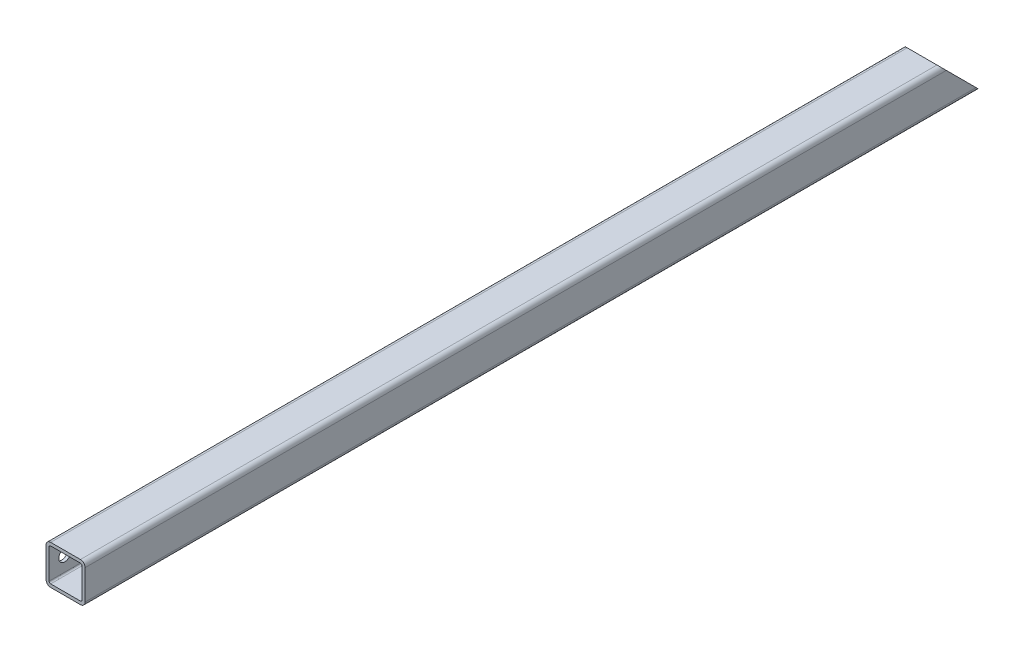
ISO-10303-21;
HEADER;
FILE_DESCRIPTION(('STEP AP214'),'2;1');
FILE_NAME('part.step','',(''),(''),'','','');
FILE_SCHEMA(('AUTOMOTIVE_DESIGN { 1 0 10303 214 1 1 1 1 }'));
ENDSEC;
DATA;
#1=APPLICATION_CONTEXT('core data for automotive mechanical design processes');
#2=APPLICATION_PROTOCOL_DEFINITION('international standard','automotive_design',2000,#1);
#3=PRODUCT_CONTEXT('',#1,'mechanical');
#4=PRODUCT('Part','Part','',(#3));
#5=PRODUCT_RELATED_PRODUCT_CATEGORY('part','',(#4));
#6=PRODUCT_DEFINITION_FORMATION('','',#4);
#7=PRODUCT_DEFINITION_CONTEXT('part definition',#1,'design');
#8=PRODUCT_DEFINITION('design','',#6,#7);
#9=PRODUCT_DEFINITION_SHAPE('','',#8);
#10=(LENGTH_UNIT() NAMED_UNIT(*) SI_UNIT(.MILLI.,.METRE.));
#11=(NAMED_UNIT(*) PLANE_ANGLE_UNIT() SI_UNIT($,.RADIAN.));
#12=(NAMED_UNIT(*) SI_UNIT($,.STERADIAN.) SOLID_ANGLE_UNIT());
#13=UNCERTAINTY_MEASURE_WITH_UNIT(LENGTH_MEASURE(1.E-05),#10,'distance_accuracy_value','');
#14=(GEOMETRIC_REPRESENTATION_CONTEXT(3) GLOBAL_UNCERTAINTY_ASSIGNED_CONTEXT((#13)) GLOBAL_UNIT_ASSIGNED_CONTEXT((#10,
#11,#12)) REPRESENTATION_CONTEXT('',''));
#15=CARTESIAN_POINT('',(0.,0.,0.));
#16=DIRECTION('',(0.,0.,1.));
#17=DIRECTION('',(1.,0.,0.));
#18=AXIS2_PLACEMENT_3D('',#15,#16,#17);
#19=CARTESIAN_POINT('',(-6.25277607468888E-12,1.69109171110904E-11,560.));
#20=DIRECTION('',(0.,0.,1.));
#21=DIRECTION('',(0.,-1.,0.));
#22=AXIS2_PLACEMENT_3D('',#19,#20,#21);
#23=PLANE('',#22);
#24=DIRECTION('',(0.,1.,0.));
#25=VECTOR('',#24,1.);
#26=CARTESIAN_POINT('',(-12.5000000000063,-4.7499999999831,560.));
#27=LINE('',#26,#25);
#28=CARTESIAN_POINT('',(-12.5000000000063,-9.49999999998312,560.));
#29=VERTEX_POINT('',#28);
#30=CARTESIAN_POINT('',(-12.5000000000063,9.50000000001687,560.));
#31=VERTEX_POINT('',#30);
#32=EDGE_CURVE('E241',#29,#31,#27,.T.);
#33=ORIENTED_EDGE('',*,*,#32,.F.);
#34=CARTESIAN_POINT('',(-9.50000000000625,-9.49999999998312,560.));
#35=DIRECTION('',(0.,0.,-1.));
#36=DIRECTION('',(1.,0.,0.));
#37=AXIS2_PLACEMENT_3D('',#34,#35,#36);
#38=CIRCLE('',#37,3.);
#39=CARTESIAN_POINT('',(-9.50000000000625,-12.4999999999831,560.));
#40=VERTEX_POINT('',#39);
#41=EDGE_CURVE('E313',#40,#29,#38,.T.);
#42=ORIENTED_EDGE('',*,*,#41,.F.);
#43=DIRECTION('',(-1.,0.,0.));
#44=VECTOR('',#43,1.);
#45=CARTESIAN_POINT('',(4.74999999999376,-12.4999999999831,560.));
#46=LINE('',#45,#44);
#47=CARTESIAN_POINT('',(9.49999999999374,-12.4999999999831,560.));
#48=VERTEX_POINT('',#47);
#49=EDGE_CURVE('E324',#48,#40,#46,.T.);
#50=ORIENTED_EDGE('',*,*,#49,.F.);
#51=CARTESIAN_POINT('',(9.49999999999374,-9.49999999998312,560.));
#52=DIRECTION('',(0.,0.,-1.));
#53=DIRECTION('',(0.,1.,0.));
#54=AXIS2_PLACEMENT_3D('',#51,#52,#53);
#55=CIRCLE('',#54,3.);
#56=CARTESIAN_POINT('',(12.4999999999937,-9.49999999998312,560.));
#57=VERTEX_POINT('',#56);
#58=EDGE_CURVE('E245',#57,#48,#55,.T.);
#59=ORIENTED_EDGE('',*,*,#58,.F.);
#60=DIRECTION('',(0.,-1.,0.));
#61=VECTOR('',#60,1.);
#62=CARTESIAN_POINT('',(12.4999999999937,4.75000000001685,560.));
#63=LINE('',#62,#61);
#64=CARTESIAN_POINT('',(12.4999999999937,9.50000000001687,560.));
#65=VERTEX_POINT('',#64);
#66=EDGE_CURVE('E321',#65,#57,#63,.T.);
#67=ORIENTED_EDGE('',*,*,#66,.F.);
#68=CARTESIAN_POINT('',(9.49999999999374,9.50000000001687,560.));
#69=DIRECTION('',(0.,0.,-1.));
#70=DIRECTION('',(-1.,0.,0.));
#71=AXIS2_PLACEMENT_3D('',#68,#69,#70);
#72=CIRCLE('',#71,3.);
#73=CARTESIAN_POINT('',(9.49999999999374,12.5000000000169,560.));
#74=VERTEX_POINT('',#73);
#75=EDGE_CURVE('E11',#74,#65,#72,.T.);
#76=ORIENTED_EDGE('',*,*,#75,.F.);
#77=DIRECTION('',(1.,0.,0.));
#78=VECTOR('',#77,1.);
#79=CARTESIAN_POINT('',(-4.75000000000627,12.5000000000169,560.));
#80=LINE('',#79,#78);
#81=CARTESIAN_POINT('',(-9.50000000000625,12.5000000000169,560.));
#82=VERTEX_POINT('',#81);
#83=EDGE_CURVE('E238',#82,#74,#80,.T.);
#84=ORIENTED_EDGE('',*,*,#83,.F.);
#85=CARTESIAN_POINT('',(-9.50000000000625,9.50000000001687,560.));
#86=DIRECTION('',(0.,0.,-1.));
#87=DIRECTION('',(0.,-1.,0.));
#88=AXIS2_PLACEMENT_3D('',#85,#86,#87);
#89=CIRCLE('',#88,3.);
#90=EDGE_CURVE('E336',#31,#82,#89,.T.);
#91=ORIENTED_EDGE('',*,*,#90,.F.);
#92=EDGE_LOOP('',(#33,#42,#50,#59,#67,#76,#84,#91));
#93=FACE_BOUND('',#92,.T.);
#94=DIRECTION('',(-1.,0.,0.));
#95=VECTOR('',#94,1.);
#96=CARTESIAN_POINT('',(-4.75000000000627,10.5000000000169,560.));
#97=LINE('',#96,#95);
#98=CARTESIAN_POINT('',(9.49999999999374,10.5000000000169,560.));
#99=VERTEX_POINT('',#98);
#100=CARTESIAN_POINT('',(-9.50000000000625,10.5000000000169,560.));
#101=VERTEX_POINT('',#100);
#102=EDGE_CURVE('E229',#99,#101,#97,.T.);
#103=ORIENTED_EDGE('',*,*,#102,.F.);
#104=CARTESIAN_POINT('',(9.49999999999374,9.50000000001687,560.));
#105=DIRECTION('',(0.,0.,1.));
#106=DIRECTION('',(-1.,0.,0.));
#107=AXIS2_PLACEMENT_3D('',#104,#105,#106);
#108=CIRCLE('',#107,1.);
#109=CARTESIAN_POINT('',(10.4999999999938,9.50000000001687,560.));
#110=VERTEX_POINT('',#109);
#111=EDGE_CURVE('E234',#110,#99,#108,.T.);
#112=ORIENTED_EDGE('',*,*,#111,.F.);
#113=DIRECTION('',(0.,1.,0.));
#114=VECTOR('',#113,1.);
#115=CARTESIAN_POINT('',(10.4999999999938,4.75000000001685,560.));
#116=LINE('',#115,#114);
#117=CARTESIAN_POINT('',(10.4999999999938,-9.49999999998312,560.));
#118=VERTEX_POINT('',#117);
#119=EDGE_CURVE('E285',#118,#110,#116,.T.);
#120=ORIENTED_EDGE('',*,*,#119,.F.);
#121=CARTESIAN_POINT('',(9.49999999999374,-9.49999999998312,560.));
#122=DIRECTION('',(0.,0.,1.));
#123=DIRECTION('',(0.,1.,0.));
#124=AXIS2_PLACEMENT_3D('',#121,#122,#123);
#125=CIRCLE('',#124,1.);
#126=CARTESIAN_POINT('',(9.49999999999374,-10.4999999999831,560.));
#127=VERTEX_POINT('',#126);
#128=EDGE_CURVE('E284',#127,#118,#125,.T.);
#129=ORIENTED_EDGE('',*,*,#128,.F.);
#130=DIRECTION('',(1.,0.,0.));
#131=VECTOR('',#130,1.);
#132=CARTESIAN_POINT('',(4.74999999999376,-10.4999999999831,560.));
#133=LINE('',#132,#131);
#134=CARTESIAN_POINT('',(-9.50000000000625,-10.4999999999831,560.));
#135=VERTEX_POINT('',#134);
#136=EDGE_CURVE('E317',#135,#127,#133,.T.);
#137=ORIENTED_EDGE('',*,*,#136,.F.);
#138=CARTESIAN_POINT('',(-9.50000000000625,-9.49999999998312,560.));
#139=DIRECTION('',(0.,0.,1.));
#140=DIRECTION('',(1.,0.,0.));
#141=AXIS2_PLACEMENT_3D('',#138,#139,#140);
#142=CIRCLE('',#141,1.);
#143=CARTESIAN_POINT('',(-10.5000000000063,-9.49999999998312,560.));
#144=VERTEX_POINT('',#143);
#145=EDGE_CURVE('E20',#144,#135,#142,.T.);
#146=ORIENTED_EDGE('',*,*,#145,.F.);
#147=DIRECTION('',(0.,-1.,0.));
#148=VECTOR('',#147,1.);
#149=CARTESIAN_POINT('',(-10.5000000000063,-4.7499999999831,560.));
#150=LINE('',#149,#148);
#151=CARTESIAN_POINT('',(-10.5000000000063,9.50000000001687,560.));
#152=VERTEX_POINT('',#151);
#153=EDGE_CURVE('E337',#152,#144,#150,.T.);
#154=ORIENTED_EDGE('',*,*,#153,.F.);
#155=CARTESIAN_POINT('',(-9.50000000000625,9.50000000001687,560.));
#156=DIRECTION('',(0.,0.,1.));
#157=DIRECTION('',(0.,-1.,0.));
#158=AXIS2_PLACEMENT_3D('',#155,#156,#157);
#159=CIRCLE('',#158,1.);
#160=EDGE_CURVE('E333',#101,#152,#159,.T.);
#161=ORIENTED_EDGE('',*,*,#160,.F.);
#162=EDGE_LOOP('',(#103,#112,#120,#129,#137,#146,#154,#161));
#163=FACE_BOUND('',#162,.T.);
#164=ADVANCED_FACE('F16',(#93,#163),#23,.T.);
#165=CARTESIAN_POINT('',(9.49999999999374,9.50000000001751,2.73558953267639E-12));
#166=DIRECTION('',(0.,0.,1.));
#167=DIRECTION('',(-1.,0.,0.));
#168=AXIS2_PLACEMENT_3D('',#165,#166,#167);
#169=CYLINDRICAL_SURFACE('',#168,3.);
#170=CARTESIAN_POINT('',(9.49999999999381,9.50000000001751,9.50000000000275));
#171=DIRECTION('',(0.,-0.707106781186548,0.707106781186547));
#172=DIRECTION('',(0.,-0.707106781186547,-0.707106781186548));
#173=AXIS2_PLACEMENT_3D('',#170,#171,#172);
#174=ELLIPSE('',#173,4.24264068711928,3.);
#175=CARTESIAN_POINT('',(12.4999999999938,9.50000000001751,9.50000000000276));
#176=VERTEX_POINT('',#175);
#177=CARTESIAN_POINT('',(9.49999999999374,12.5000000000175,12.5000000000028));
#178=VERTEX_POINT('',#177);
#179=EDGE_CURVE('E310',#176,#178,#174,.T.);
#180=ORIENTED_EDGE('',*,*,#179,.T.);
#181=DIRECTION('',(0.,0.,-1.));
#182=VECTOR('',#181,1.);
#183=CARTESIAN_POINT('',(9.49999999999374,12.5000000000175,2.73558953267639E-12));
#184=LINE('',#183,#182);
#185=EDGE_CURVE('E27',#74,#178,#184,.T.);
#186=ORIENTED_EDGE('',*,*,#185,.F.);
#187=ORIENTED_EDGE('',*,*,#75,.T.);
#188=DIRECTION('',(0.,0.,-1.));
#189=VECTOR('',#188,1.);
#190=CARTESIAN_POINT('',(12.4999999999937,9.50000000001751,2.73558953267639E-12));
#191=LINE('',#190,#189);
#192=EDGE_CURVE('E325',#65,#176,#191,.T.);
#193=ORIENTED_EDGE('',*,*,#192,.T.);
#194=EDGE_LOOP('',(#180,#186,#187,#193));
#195=FACE_BOUND('',#194,.T.);
#196=ADVANCED_FACE('F571',(#195),#169,.T.);
#197=CARTESIAN_POINT('',(-9.50000000000625,12.5000000000175,2.73558953267639E-12));
#198=DIRECTION('',(0.,1.,0.));
#199=DIRECTION('',(0.,0.,-1.));
#200=AXIS2_PLACEMENT_3D('',#197,#198,#199);
#201=PLANE('',#200);
#202=DIRECTION('',(-1.,0.,0.));
#203=VECTOR('',#202,1.);
#204=CARTESIAN_POINT('',(-4.75000000000627,12.5000000000175,12.5000000000028));
#205=LINE('',#204,#203);
#206=CARTESIAN_POINT('',(-9.50000000000625,12.5000000000175,12.5000000000028));
#207=VERTEX_POINT('',#206);
#208=EDGE_CURVE('E288',#178,#207,#205,.T.);
#209=ORIENTED_EDGE('',*,*,#208,.T.);
#210=DIRECTION('',(0.,0.,-1.));
#211=VECTOR('',#210,1.);
#212=CARTESIAN_POINT('',(-9.50000000000625,12.5000000000175,2.73558953267639E-12));
#213=LINE('',#212,#211);
#214=EDGE_CURVE('E293',#82,#207,#213,.T.);
#215=ORIENTED_EDGE('',*,*,#214,.F.);
#216=ORIENTED_EDGE('',*,*,#83,.T.);
#217=ORIENTED_EDGE('',*,*,#185,.T.);
#218=EDGE_LOOP('',(#209,#215,#216,#217));
#219=FACE_BOUND('',#218,.T.);
#220=ADVANCED_FACE('F576',(#219),#201,.T.);
#221=CARTESIAN_POINT('',(-9.50000000000625,9.50000000001751,2.73558953267639E-12));
#222=DIRECTION('',(0.,0.,1.));
#223=DIRECTION('',(0.,-1.,0.));
#224=AXIS2_PLACEMENT_3D('',#221,#222,#223);
#225=CYLINDRICAL_SURFACE('',#224,3.);
#226=CARTESIAN_POINT('',(-9.50000000000617,9.50000000001744,9.50000000000275));
#227=DIRECTION('',(0.,-0.707106781186548,0.707106781186547));
#228=DIRECTION('',(0.,-0.707106781186547,-0.707106781186548));
#229=AXIS2_PLACEMENT_3D('',#226,#227,#228);
#230=ELLIPSE('',#229,4.24264068711928,3.);
#231=CARTESIAN_POINT('',(-12.5000000000062,9.50000000001744,9.50000000000275));
#232=VERTEX_POINT('',#231);
#233=EDGE_CURVE('E286',#207,#232,#230,.T.);
#234=ORIENTED_EDGE('',*,*,#233,.T.);
#235=DIRECTION('',(0.,0.,-1.));
#236=VECTOR('',#235,1.);
#237=CARTESIAN_POINT('',(-12.5000000000063,9.50000000001751,2.73558953267639E-12));
#238=LINE('',#237,#236);
#239=EDGE_CURVE('E185',#31,#232,#238,.T.);
#240=ORIENTED_EDGE('',*,*,#239,.F.);
#241=ORIENTED_EDGE('',*,*,#90,.T.);
#242=ORIENTED_EDGE('',*,*,#214,.T.);
#243=EDGE_LOOP('',(#234,#240,#241,#242));
#244=FACE_BOUND('',#243,.T.);
#245=ADVANCED_FACE('F611',(#244),#225,.T.);
#246=CARTESIAN_POINT('',(-9.50000000000625,9.50000000001751,2.73558953267639E-12));
#247=DIRECTION('',(0.,0.,1.));
#248=DIRECTION('',(0.,-1.,0.));
#249=AXIS2_PLACEMENT_3D('',#246,#247,#248);
#250=CYLINDRICAL_SURFACE('',#249,1.);
#251=CARTESIAN_POINT('',(-9.50000000000617,9.50000000001744,9.50000000000275));
#252=DIRECTION('',(0.,0.707106781186548,-0.707106781186547));
#253=DIRECTION('',(0.,-0.707106781186547,-0.707106781186548));
#254=AXIS2_PLACEMENT_3D('',#251,#252,#253);
#255=ELLIPSE('',#254,1.4142135623731,1.);
#256=CARTESIAN_POINT('',(-10.5000000000062,9.50000000001744,9.50000000000276));
#257=VERTEX_POINT('',#256);
#258=CARTESIAN_POINT('',(-9.50000000000625,10.5000000000175,10.5000000000028));
#259=VERTEX_POINT('',#258);
#260=EDGE_CURVE('E257',#257,#259,#255,.T.);
#261=ORIENTED_EDGE('',*,*,#260,.T.);
#262=DIRECTION('',(0.,0.,-1.));
#263=VECTOR('',#262,1.);
#264=CARTESIAN_POINT('',(-9.50000000000625,10.5000000000175,2.73558953267639E-12));
#265=LINE('',#264,#263);
#266=EDGE_CURVE('E235',#101,#259,#265,.T.);
#267=ORIENTED_EDGE('',*,*,#266,.F.);
#268=ORIENTED_EDGE('',*,*,#160,.T.);
#269=DIRECTION('',(0.,0.,1.));
#270=VECTOR('',#269,1.);
#271=CARTESIAN_POINT('',(-10.5000000000063,9.50000000001751,2.73558953267639E-12));
#272=LINE('',#271,#270);
#273=EDGE_CURVE('E374',#257,#152,#272,.T.);
#274=ORIENTED_EDGE('',*,*,#273,.F.);
#275=EDGE_LOOP('',(#261,#267,#268,#274));
#276=FACE_BOUND('',#275,.T.);
#277=ADVANCED_FACE('F427',(#276),#250,.F.);
#278=CARTESIAN_POINT('',(-10.5000000000063,-9.49999999998255,2.73558953267639E-12));
#279=DIRECTION('',(-1.,0.,0.));
#280=DIRECTION('',(0.,1.,0.));
#281=AXIS2_PLACEMENT_3D('',#278,#279,#280);
#282=PLANE('',#281);
#283=CARTESIAN_POINT('',(-10.5000000000191,3.05533376376843E-11,549.999999961888));
#284=DIRECTION('',(-1.,0.,0.));
#285=DIRECTION('',(0.,0.,1.));
#286=AXIS2_PLACEMENT_3D('',#283,#284,#285);
#287=CIRCLE('',#286,3.8235);
#288=CARTESIAN_POINT('',(-10.5000000000189,3.05533376376843E-11,546.176499961887));
#289=VERTEX_POINT('',#288);
#290=EDGE_CURVE('E230',#289,#289,#287,.T.);
#291=ORIENTED_EDGE('',*,*,#290,.T.);
#292=EDGE_LOOP('',(#291));
#293=FACE_BOUND('',#292,.T.);
#294=CARTESIAN_POINT('',(-10.5000000000063,2.25242047235952E-11,-7.15411729856896E-09));
#295=DIRECTION('',(-1.,0.,0.));
#296=DIRECTION('',(0.,0.,1.));
#297=AXIS2_PLACEMENT_3D('',#294,#295,#296);
#298=CIRCLE('',#297,3.8235);
#299=CARTESIAN_POINT('',(-10.5000000000062,-2.70362278142521,-2.70362278143988));
#300=VERTEX_POINT('',#299);
#301=CARTESIAN_POINT('',(-10.5000000000062,2.70362277430827,2.70362277429363));
#302=VERTEX_POINT('',#301);
#303=EDGE_CURVE('E201',#300,#302,#298,.T.);
#304=ORIENTED_EDGE('',*,*,#303,.T.);
#305=DIRECTION('',(0.,0.707106781186547,0.707106781186548));
#306=VECTOR('',#305,1.);
#307=CARTESIAN_POINT('',(-10.5000000000062,-2.37499999998256,-2.37499999999722));
#308=LINE('',#307,#306);
#309=EDGE_CURVE('E196',#302,#257,#308,.T.);
#310=ORIENTED_EDGE('',*,*,#309,.T.);
#311=ORIENTED_EDGE('',*,*,#273,.T.);
#312=ORIENTED_EDGE('',*,*,#153,.T.);
#313=DIRECTION('',(0.,0.,-1.));
#314=VECTOR('',#313,1.);
#315=CARTESIAN_POINT('',(-10.5000000000063,-9.49999999998255,2.73558953267639E-12));
#316=LINE('',#315,#314);
#317=CARTESIAN_POINT('',(-10.5000000000063,-9.49999999998255,-9.49999999999722));
#318=VERTEX_POINT('',#317);
#319=EDGE_CURVE('E359',#144,#318,#316,.T.);
#320=ORIENTED_EDGE('',*,*,#319,.T.);
#321=DIRECTION('',(0.,0.707106781186547,0.707106781186548));
#322=VECTOR('',#321,1.);
#323=CARTESIAN_POINT('',(-10.5000000000062,-2.37499999998256,-2.37499999999722));
#324=LINE('',#323,#322);
#325=EDGE_CURVE('E216',#318,#300,#324,.T.);
#326=ORIENTED_EDGE('',*,*,#325,.T.);
#327=EDGE_LOOP('',(#304,#310,#311,#312,#320,#326));
#328=FACE_BOUND('',#327,.T.);
#329=ADVANCED_FACE('F660',(#293,#328),#282,.F.);
#330=CARTESIAN_POINT('',(-9.50000000000625,-9.49999999998255,2.73558953267639E-12));
#331=DIRECTION('',(0.,0.,1.));
#332=DIRECTION('',(1.,0.,0.));
#333=AXIS2_PLACEMENT_3D('',#330,#331,#332);
#334=CYLINDRICAL_SURFACE('',#333,1.);
#335=CARTESIAN_POINT('',(-9.50000000000625,-9.49999999998255,-9.49999999999722));
#336=DIRECTION('',(0.,0.707106781186548,-0.707106781186547));
#337=DIRECTION('',(0.,0.707106781186547,0.707106781186548));
#338=AXIS2_PLACEMENT_3D('',#335,#336,#337);
#339=ELLIPSE('',#338,1.4142135623731,1.);
#340=CARTESIAN_POINT('',(-9.50000000000625,-10.4999999999825,-10.4999999999972));
#341=VERTEX_POINT('',#340);
#342=EDGE_CURVE('E219',#341,#318,#339,.T.);
#343=ORIENTED_EDGE('',*,*,#342,.T.);
#344=ORIENTED_EDGE('',*,*,#319,.F.);
#345=ORIENTED_EDGE('',*,*,#145,.T.);
#346=DIRECTION('',(0.,0.,-1.));
#347=VECTOR('',#346,1.);
#348=CARTESIAN_POINT('',(-9.50000000000625,-10.4999999999825,2.73558953267639E-12));
#349=LINE('',#348,#347);
#350=EDGE_CURVE('E314',#135,#341,#349,.T.);
#351=ORIENTED_EDGE('',*,*,#350,.T.);
#352=EDGE_LOOP('',(#343,#344,#345,#351));
#353=FACE_BOUND('',#352,.T.);
#354=ADVANCED_FACE('F565',(#353),#334,.F.);
#355=CARTESIAN_POINT('',(9.49999999999374,-12.4999999999825,2.73558953267639E-12));
#356=DIRECTION('',(0.,-1.,0.));
#357=DIRECTION('',(0.,0.,-1.));
#358=AXIS2_PLACEMENT_3D('',#355,#356,#357);
#359=PLANE('',#358);
#360=ORIENTED_EDGE('',*,*,#49,.T.);
#361=DIRECTION('',(0.,0.,1.));
#362=VECTOR('',#361,1.);
#363=CARTESIAN_POINT('',(-9.50000000000625,-12.4999999999825,2.73558953267639E-12));
#364=LINE('',#363,#362);
#365=CARTESIAN_POINT('',(-9.50000000000625,-12.4999999999825,-12.5000000999973));
#366=VERTEX_POINT('',#365);
#367=EDGE_CURVE('E304',#366,#40,#364,.T.);
#368=ORIENTED_EDGE('',*,*,#367,.F.);
#369=DIRECTION('',(-1.,0.,0.));
#370=VECTOR('',#369,1.);
#371=CARTESIAN_POINT('',(4.74999999999376,-12.4999999999825,-12.5000000999973));
#372=LINE('',#371,#370);
#373=CARTESIAN_POINT('',(9.49999999999374,-12.4999999999825,-12.5000000999973));
#374=VERTEX_POINT('',#373);
#375=EDGE_CURVE('E255',#374,#366,#372,.T.);
#376=ORIENTED_EDGE('',*,*,#375,.F.);
#377=DIRECTION('',(0.,0.,-1.));
#378=VECTOR('',#377,1.);
#379=CARTESIAN_POINT('',(9.49999999999374,-12.4999999999825,2.73558953267639E-12));
#380=LINE('',#379,#378);
#381=EDGE_CURVE('E249',#48,#374,#380,.T.);
#382=ORIENTED_EDGE('',*,*,#381,.F.);
#383=EDGE_LOOP('',(#360,#368,#376,#382));
#384=FACE_BOUND('',#383,.T.);
#385=ADVANCED_FACE('F559',(#384),#359,.T.);
#386=CARTESIAN_POINT('',(12.4999999999937,9.50000000001751,2.73558953267639E-12));
#387=DIRECTION('',(1.,0.,0.));
#388=DIRECTION('',(0.,1.,0.));
#389=AXIS2_PLACEMENT_3D('',#386,#387,#388);
#390=PLANE('',#389);
#391=DIRECTION('',(0.,0.707106781186547,0.707106781186548));
#392=VECTOR('',#391,1.);
#393=CARTESIAN_POINT('',(12.4999999999937,2.37500000001745,2.37500000000278));
#394=LINE('',#393,#392);
#395=CARTESIAN_POINT('',(12.4999999999937,-9.49999999998248,-9.49999999999722));
#396=VERTEX_POINT('',#395);
#397=EDGE_CURVE('E256',#396,#176,#394,.T.);
#398=ORIENTED_EDGE('',*,*,#397,.T.);
#399=ORIENTED_EDGE('',*,*,#192,.F.);
#400=ORIENTED_EDGE('',*,*,#66,.T.);
#401=DIRECTION('',(0.,0.,-1.));
#402=VECTOR('',#401,1.);
#403=CARTESIAN_POINT('',(12.4999999999937,-9.49999999998255,2.73558953267639E-12));
#404=LINE('',#403,#402);
#405=EDGE_CURVE('E250',#57,#396,#404,.T.);
#406=ORIENTED_EDGE('',*,*,#405,.T.);
#407=EDGE_LOOP('',(#398,#399,#400,#406));
#408=FACE_BOUND('',#407,.T.);
#409=ADVANCED_FACE('F564',(#408),#390,.T.);
#410=CARTESIAN_POINT('',(9.49999999999374,-10.4999999999825,2.73558953267639E-12));
#411=DIRECTION('',(0.,-1.,0.));
#412=DIRECTION('',(0.,0.,-1.));
#413=AXIS2_PLACEMENT_3D('',#410,#411,#412);
#414=PLANE('',#413);
#415=DIRECTION('',(-1.,0.,0.));
#416=VECTOR('',#415,1.);
#417=CARTESIAN_POINT('',(4.74999999999376,-10.4999999999825,-10.4999999999972));
#418=LINE('',#417,#416);
#419=CARTESIAN_POINT('',(9.49999999999374,-10.4999999999825,-10.4999999999972));
#420=VERTEX_POINT('',#419);
#421=EDGE_CURVE('E265',#420,#341,#418,.T.);
#422=ORIENTED_EDGE('',*,*,#421,.T.);
#423=ORIENTED_EDGE('',*,*,#350,.F.);
#424=ORIENTED_EDGE('',*,*,#136,.T.);
#425=DIRECTION('',(0.,0.,-1.));
#426=VECTOR('',#425,1.);
#427=CARTESIAN_POINT('',(9.49999999999374,-10.4999999999825,2.73558953267639E-12));
#428=LINE('',#427,#426);
#429=EDGE_CURVE('E281',#127,#420,#428,.T.);
#430=ORIENTED_EDGE('',*,*,#429,.T.);
#431=EDGE_LOOP('',(#422,#423,#424,#430));
#432=FACE_BOUND('',#431,.T.);
#433=ADVANCED_FACE('F18',(#432),#414,.F.);
#434=CARTESIAN_POINT('',(9.49999999999374,-9.49999999998255,2.73558953267639E-12));
#435=DIRECTION('',(0.,0.,1.));
#436=DIRECTION('',(0.,1.,0.));
#437=AXIS2_PLACEMENT_3D('',#434,#435,#436);
#438=CYLINDRICAL_SURFACE('',#437,3.);
#439=CARTESIAN_POINT('',(9.49999999999374,-9.49999999998248,-9.49999999999722));
#440=DIRECTION('',(0.,-0.707106781186548,0.707106781186547));
#441=DIRECTION('',(0.,0.707106781186547,0.707106781186548));
#442=AXIS2_PLACEMENT_3D('',#439,#440,#441);
#443=ELLIPSE('',#442,4.24264068711928,3.);
#444=EDGE_CURVE('E251',#374,#396,#443,.T.);
#445=ORIENTED_EDGE('',*,*,#444,.T.);
#446=ORIENTED_EDGE('',*,*,#405,.F.);
#447=ORIENTED_EDGE('',*,*,#58,.T.);
#448=ORIENTED_EDGE('',*,*,#381,.T.);
#449=EDGE_LOOP('',(#445,#446,#447,#448));
#450=FACE_BOUND('',#449,.T.);
#451=ADVANCED_FACE('F594',(#450),#438,.T.);
#452=CARTESIAN_POINT('',(-9.50000000000625,-9.49999999998255,2.73558953267639E-12));
#453=DIRECTION('',(0.,0.,1.));
#454=DIRECTION('',(1.,0.,0.));
#455=AXIS2_PLACEMENT_3D('',#452,#453,#454);
#456=CYLINDRICAL_SURFACE('',#455,3.);
#457=CARTESIAN_POINT('',(-9.50000000000625,-9.49999999998255,-9.49999999999722));
#458=DIRECTION('',(0.,-0.707106781186548,0.707106781186547));
#459=DIRECTION('',(0.,0.707106781186547,0.707106781186548));
#460=AXIS2_PLACEMENT_3D('',#457,#458,#459);
#461=ELLIPSE('',#460,4.24264068711928,3.);
#462=CARTESIAN_POINT('',(-12.5000000000063,-9.49999999998255,-9.49999999999724));
#463=VERTEX_POINT('',#462);
#464=EDGE_CURVE('E214',#463,#366,#461,.T.);
#465=ORIENTED_EDGE('',*,*,#464,.T.);
#466=ORIENTED_EDGE('',*,*,#367,.T.);
#467=ORIENTED_EDGE('',*,*,#41,.T.);
#468=DIRECTION('',(0.,0.,-1.));
#469=VECTOR('',#468,1.);
#470=CARTESIAN_POINT('',(-12.5000000000063,-9.49999999998255,2.73558953267639E-12));
#471=LINE('',#470,#469);
#472=EDGE_CURVE('E272',#29,#463,#471,.T.);
#473=ORIENTED_EDGE('',*,*,#472,.T.);
#474=EDGE_LOOP('',(#465,#466,#467,#473));
#475=FACE_BOUND('',#474,.T.);
#476=ADVANCED_FACE('F588',(#475),#456,.T.);
#477=CARTESIAN_POINT('',(9.49999999999374,-9.49999999998255,2.73558953267639E-12));
#478=DIRECTION('',(0.,0.,1.));
#479=DIRECTION('',(0.,1.,0.));
#480=AXIS2_PLACEMENT_3D('',#477,#478,#479);
#481=CYLINDRICAL_SURFACE('',#480,1.);
#482=CARTESIAN_POINT('',(9.49999999999374,-9.49999999998248,-9.49999999999722));
#483=DIRECTION('',(0.,0.707106781186548,-0.707106781186547));
#484=DIRECTION('',(0.,0.707106781186547,0.707106781186548));
#485=AXIS2_PLACEMENT_3D('',#482,#483,#484);
#486=ELLIPSE('',#485,1.4142135623731,1.);
#487=CARTESIAN_POINT('',(10.4999999999938,-9.49999999998248,-9.49999999999724));
#488=VERTEX_POINT('',#487);
#489=EDGE_CURVE('E225',#488,#420,#486,.T.);
#490=ORIENTED_EDGE('',*,*,#489,.T.);
#491=ORIENTED_EDGE('',*,*,#429,.F.);
#492=ORIENTED_EDGE('',*,*,#128,.T.);
#493=DIRECTION('',(0.,0.,-1.));
#494=VECTOR('',#493,1.);
#495=CARTESIAN_POINT('',(10.4999999999938,-9.49999999998255,2.73558953267639E-12));
#496=LINE('',#495,#494);
#497=EDGE_CURVE('E297',#118,#488,#496,.T.);
#498=ORIENTED_EDGE('',*,*,#497,.T.);
#499=EDGE_LOOP('',(#490,#491,#492,#498));
#500=FACE_BOUND('',#499,.T.);
#501=ADVANCED_FACE('F398',(#500),#481,.F.);
#502=CARTESIAN_POINT('',(10.4999999999938,9.50000000001751,2.73558953267639E-12));
#503=DIRECTION('',(1.,0.,0.));
#504=DIRECTION('',(0.,-1.,0.));
#505=AXIS2_PLACEMENT_3D('',#502,#503,#504);
#506=PLANE('',#505);
#507=DIRECTION('',(0.,-0.707106781186547,-0.707106781186548));
#508=VECTOR('',#507,1.);
#509=CARTESIAN_POINT('',(10.4999999999938,2.37500000001745,2.37500000000276));
#510=LINE('',#509,#508);
#511=CARTESIAN_POINT('',(10.4999999999938,9.50000000001751,9.50000000000275));
#512=VERTEX_POINT('',#511);
#513=EDGE_CURVE('E220',#512,#488,#510,.T.);
#514=ORIENTED_EDGE('',*,*,#513,.T.);
#515=ORIENTED_EDGE('',*,*,#497,.F.);
#516=ORIENTED_EDGE('',*,*,#119,.T.);
#517=DIRECTION('',(0.,0.,-1.));
#518=VECTOR('',#517,1.);
#519=CARTESIAN_POINT('',(10.4999999999938,9.50000000001751,2.73558953267639E-12));
#520=LINE('',#519,#518);
#521=EDGE_CURVE('E231',#110,#512,#520,.T.);
#522=ORIENTED_EDGE('',*,*,#521,.T.);
#523=EDGE_LOOP('',(#514,#515,#516,#522));
#524=FACE_BOUND('',#523,.T.);
#525=ADVANCED_FACE('F587',(#524),#506,.F.);
#526=CARTESIAN_POINT('',(9.49999999999374,9.50000000001751,2.73558953267639E-12));
#527=DIRECTION('',(0.,0.,1.));
#528=DIRECTION('',(-1.,0.,0.));
#529=AXIS2_PLACEMENT_3D('',#526,#527,#528);
#530=CYLINDRICAL_SURFACE('',#529,1.);
#531=CARTESIAN_POINT('',(9.49999999999381,9.50000000001751,9.50000000000275));
#532=DIRECTION('',(0.,0.707106781186548,-0.707106781186547));
#533=DIRECTION('',(0.,-0.707106781186547,-0.707106781186548));
#534=AXIS2_PLACEMENT_3D('',#531,#532,#533);
#535=ELLIPSE('',#534,1.4142135623731,1.);
#536=CARTESIAN_POINT('',(9.49999999999374,10.5000000000175,10.5000000000028));
#537=VERTEX_POINT('',#536);
#538=EDGE_CURVE('E224',#537,#512,#535,.T.);
#539=ORIENTED_EDGE('',*,*,#538,.T.);
#540=ORIENTED_EDGE('',*,*,#521,.F.);
#541=ORIENTED_EDGE('',*,*,#111,.T.);
#542=DIRECTION('',(0.,0.,-1.));
#543=VECTOR('',#542,1.);
#544=CARTESIAN_POINT('',(9.49999999999374,10.5000000000175,2.73558953267639E-12));
#545=LINE('',#544,#543);
#546=EDGE_CURVE('E226',#99,#537,#545,.T.);
#547=ORIENTED_EDGE('',*,*,#546,.T.);
#548=EDGE_LOOP('',(#539,#540,#541,#547));
#549=FACE_BOUND('',#548,.T.);
#550=ADVANCED_FACE('F654',(#549),#530,.F.);
#551=CARTESIAN_POINT('',(-9.50000000000625,10.5000000000175,2.73558953267639E-12));
#552=DIRECTION('',(0.,1.,0.));
#553=DIRECTION('',(0.,0.,-1.));
#554=AXIS2_PLACEMENT_3D('',#551,#552,#553);
#555=PLANE('',#554);
#556=DIRECTION('',(1.,0.,0.));
#557=VECTOR('',#556,1.);
#558=CARTESIAN_POINT('',(-4.75000000000627,10.5000000000175,10.5000000000028));
#559=LINE('',#558,#557);
#560=EDGE_CURVE('E261',#259,#537,#559,.T.);
#561=ORIENTED_EDGE('',*,*,#560,.T.);
#562=ORIENTED_EDGE('',*,*,#546,.F.);
#563=ORIENTED_EDGE('',*,*,#102,.T.);
#564=ORIENTED_EDGE('',*,*,#266,.T.);
#565=EDGE_LOOP('',(#561,#562,#563,#564));
#566=FACE_BOUND('',#565,.T.);
#567=ADVANCED_FACE('F422',(#566),#555,.F.);
#568=CARTESIAN_POINT('',(-17.5000000009693,3.05533376376843E-11,549.999999961887));
#569=DIRECTION('',(-1.,0.,0.));
#570=DIRECTION('',(0.,0.,1.));
#571=AXIS2_PLACEMENT_3D('',#568,#569,#570);
#572=CYLINDRICAL_SURFACE('',#571,3.8235);
#573=ORIENTED_EDGE('',*,*,#290,.F.);
#574=EDGE_LOOP('',(#573));
#575=FACE_BOUND('',#574,.T.);
#576=CARTESIAN_POINT('',(-12.500000000019,3.05533376376843E-11,549.999999961888));
#577=DIRECTION('',(1.,0.,0.));
#578=DIRECTION('',(0.,0.,1.));
#579=AXIS2_PLACEMENT_3D('',#576,#577,#578);
#580=CIRCLE('',#579,3.8235);
#581=CARTESIAN_POINT('',(-12.5000000000189,3.05533376376843E-11,546.176499961888));
#582=VERTEX_POINT('',#581);
#583=EDGE_CURVE('E189',#582,#582,#580,.T.);
#584=ORIENTED_EDGE('',*,*,#583,.F.);
#585=EDGE_LOOP('',(#584));
#586=FACE_BOUND('',#585,.T.);
#587=ADVANCED_FACE('F640',(#575,#586),#572,.F.);
#588=CARTESIAN_POINT('',(-6.25277607468888E-12,1.74793512996985E-11,2.75335310107039E-12));
#589=DIRECTION('',(0.,-0.707106781186548,0.707106781186547));
#590=DIRECTION('',(-1.,0.,0.));
#591=AXIS2_PLACEMENT_3D('',#588,#589,#590);
#592=PLANE('',#591);
#593=DIRECTION('',(-1.,0.,0.));
#594=VECTOR('',#593,1.);
#595=CARTESIAN_POINT('',(-17.5000000009586,2.7036227743082,2.70362277429353));
#596=LINE('',#595,#594);
#597=CARTESIAN_POINT('',(-12.5000000000062,2.70362277430827,2.7036227742936));
#598=VERTEX_POINT('',#597);
#599=EDGE_CURVE('E192',#302,#598,#596,.T.);
#600=ORIENTED_EDGE('',*,*,#599,.T.);
#601=DIRECTION('',(0.,-0.707106781186547,-0.707106781186548));
#602=VECTOR('',#601,1.);
#603=CARTESIAN_POINT('',(-12.5000000000062,-2.37499999998256,-2.37499999999725));
#604=LINE('',#603,#602);
#605=EDGE_CURVE('E176',#232,#598,#604,.T.);
#606=ORIENTED_EDGE('',*,*,#605,.F.);
#607=ORIENTED_EDGE('',*,*,#233,.F.);
#608=ORIENTED_EDGE('',*,*,#208,.F.);
#609=ORIENTED_EDGE('',*,*,#179,.F.);
#610=ORIENTED_EDGE('',*,*,#397,.F.);
#611=ORIENTED_EDGE('',*,*,#444,.F.);
#612=ORIENTED_EDGE('',*,*,#375,.T.);
#613=ORIENTED_EDGE('',*,*,#464,.F.);
#614=DIRECTION('',(0.,-0.707106781186547,-0.707106781186548));
#615=VECTOR('',#614,1.);
#616=CARTESIAN_POINT('',(-12.5000000000062,-2.37499999998256,-2.37499999999725));
#617=LINE('',#616,#615);
#618=CARTESIAN_POINT('',(-12.5000000000062,-2.70362278142521,-2.70362278143992));
#619=VERTEX_POINT('',#618);
#620=EDGE_CURVE('E264',#619,#463,#617,.T.);
#621=ORIENTED_EDGE('',*,*,#620,.F.);
#622=DIRECTION('',(1.,0.,0.));
#623=VECTOR('',#622,1.);
#624=CARTESIAN_POINT('',(-17.5000000009584,-2.70362278142528,-2.70362278143999));
#625=LINE('',#624,#623);
#626=EDGE_CURVE('E205',#619,#300,#625,.T.);
#627=ORIENTED_EDGE('',*,*,#626,.T.);
#628=ORIENTED_EDGE('',*,*,#325,.F.);
#629=ORIENTED_EDGE('',*,*,#342,.F.);
#630=ORIENTED_EDGE('',*,*,#421,.F.);
#631=ORIENTED_EDGE('',*,*,#489,.F.);
#632=ORIENTED_EDGE('',*,*,#513,.F.);
#633=ORIENTED_EDGE('',*,*,#538,.F.);
#634=ORIENTED_EDGE('',*,*,#560,.F.);
#635=ORIENTED_EDGE('',*,*,#260,.F.);
#636=ORIENTED_EDGE('',*,*,#309,.F.);
#637=EDGE_LOOP('',(#600,#606,#607,#608,#609,#610,#611,#612,#613,#621,#627,#628,#629,#630,#631,
#632,#633,#634,#635,#636));
#638=FACE_BOUND('',#637,.T.);
#639=ADVANCED_FACE('F193',(#638),#592,.F.);
#640=CARTESIAN_POINT('',(-12.5000000000063,-9.49999999998255,2.73558953267639E-12));
#641=DIRECTION('',(-1.,0.,0.));
#642=DIRECTION('',(0.,1.,0.));
#643=AXIS2_PLACEMENT_3D('',#640,#641,#642);
#644=PLANE('',#643);
#645=ORIENTED_EDGE('',*,*,#583,.T.);
#646=EDGE_LOOP('',(#645));
#647=FACE_BOUND('',#646,.T.);
#648=CARTESIAN_POINT('',(-12.5000000000063,2.25242047235952E-11,-7.15417058927414E-09));
#649=DIRECTION('',(1.,0.,0.));
#650=DIRECTION('',(0.,0.,1.));
#651=AXIS2_PLACEMENT_3D('',#648,#649,#650);
#652=CIRCLE('',#651,3.8235);
#653=EDGE_CURVE('E181',#598,#619,#652,.T.);
#654=ORIENTED_EDGE('',*,*,#653,.T.);
#655=ORIENTED_EDGE('',*,*,#620,.T.);
#656=ORIENTED_EDGE('',*,*,#472,.F.);
#657=ORIENTED_EDGE('',*,*,#32,.T.);
#658=ORIENTED_EDGE('',*,*,#239,.T.);
#659=ORIENTED_EDGE('',*,*,#605,.T.);
#660=EDGE_LOOP('',(#654,#655,#656,#657,#658,#659));
#661=FACE_BOUND('',#660,.T.);
#662=ADVANCED_FACE('F178',(#647,#661),#644,.T.);
#663=CARTESIAN_POINT('',(-17.5000000009585,2.25242047235952E-11,-7.1542949342529E-09));
#664=DIRECTION('',(-1.,0.,0.));
#665=DIRECTION('',(0.,0.,1.));
#666=AXIS2_PLACEMENT_3D('',#663,#664,#665);
#667=CYLINDRICAL_SURFACE('',#666,3.8235);
#668=ORIENTED_EDGE('',*,*,#626,.F.);
#669=ORIENTED_EDGE('',*,*,#653,.F.);
#670=ORIENTED_EDGE('',*,*,#599,.F.);
#671=ORIENTED_EDGE('',*,*,#303,.F.);
#672=EDGE_LOOP('',(#668,#669,#670,#671));
#673=FACE_BOUND('',#672,.T.);
#674=ADVANCED_FACE('F203',(#673),#667,.F.);
#675=CLOSED_SHELL('',(#164,#196,#220,#245,#277,#329,#354,#385,#409,#433,#451,#476,#501,#525,
#550,#567,#587,#639,#662,#674));
#676=MANIFOLD_SOLID_BREP('B1',#675);
#677=ADVANCED_BREP_SHAPE_REPRESENTATION('',(#18,#676),#14);
#678=SHAPE_DEFINITION_REPRESENTATION(#9,#677);
ENDSEC;
END-ISO-10303-21;
